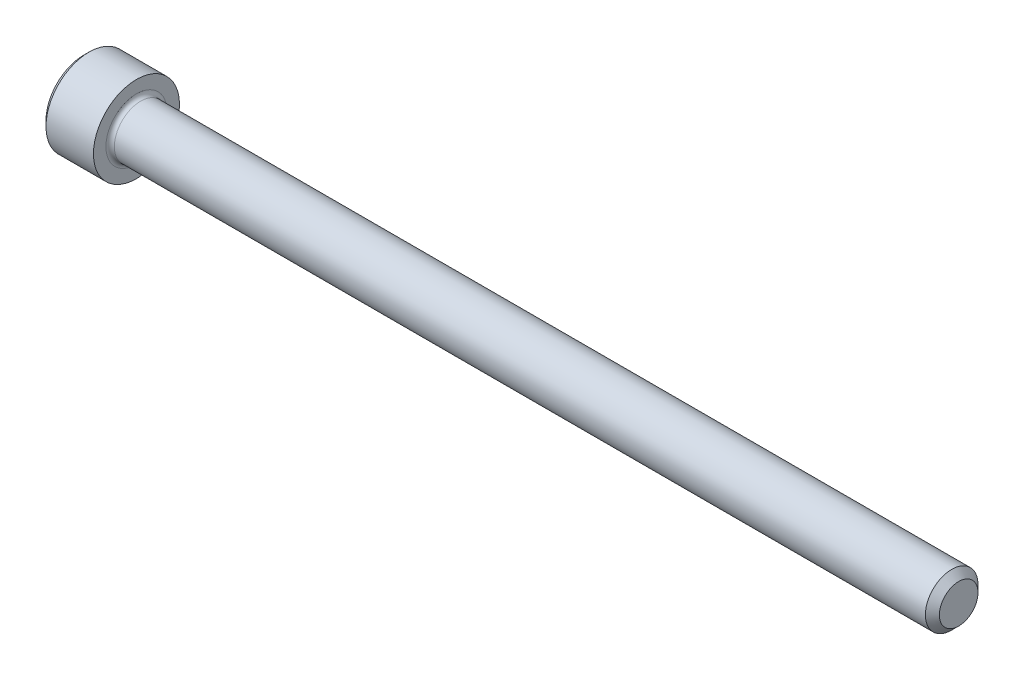
ISO-10303-21;
HEADER;
FILE_DESCRIPTION(('STEP AP214'),'2;1');
FILE_NAME('part.step','',(''),(''),'','','');
FILE_SCHEMA(('AUTOMOTIVE_DESIGN { 1 0 10303 214 1 1 1 1 }'));
ENDSEC;
DATA;
#1=APPLICATION_CONTEXT('core data for automotive mechanical design processes');
#2=APPLICATION_PROTOCOL_DEFINITION('international standard','automotive_design',2000,#1);
#3=PRODUCT_CONTEXT('',#1,'mechanical');
#4=PRODUCT('Part','Part','',(#3));
#5=PRODUCT_RELATED_PRODUCT_CATEGORY('part','',(#4));
#6=PRODUCT_DEFINITION_FORMATION('','',#4);
#7=PRODUCT_DEFINITION_CONTEXT('part definition',#1,'design');
#8=PRODUCT_DEFINITION('design','',#6,#7);
#9=PRODUCT_DEFINITION_SHAPE('','',#8);
#10=(LENGTH_UNIT() NAMED_UNIT(*) SI_UNIT(.MILLI.,.METRE.));
#11=(NAMED_UNIT(*) PLANE_ANGLE_UNIT() SI_UNIT($,.RADIAN.));
#12=(NAMED_UNIT(*) SI_UNIT($,.STERADIAN.) SOLID_ANGLE_UNIT());
#13=UNCERTAINTY_MEASURE_WITH_UNIT(LENGTH_MEASURE(1.E-05),#10,'distance_accuracy_value','');
#14=(GEOMETRIC_REPRESENTATION_CONTEXT(3) GLOBAL_UNCERTAINTY_ASSIGNED_CONTEXT((#13)) GLOBAL_UNIT_ASSIGNED_CONTEXT((#10,
#11,#12)) REPRESENTATION_CONTEXT('',''));
#15=CARTESIAN_POINT('',(0.,0.,0.));
#16=DIRECTION('',(0.,0.,1.));
#17=DIRECTION('',(1.,0.,0.));
#18=AXIS2_PLACEMENT_3D('',#15,#16,#17);
#19=CARTESIAN_POINT('',(0.,0.,0.));
#20=DIRECTION('',(-1.,0.,0.));
#21=DIRECTION('',(0.,0.,1.));
#22=AXIS2_PLACEMENT_3D('',#19,#20,#21);
#23=PLANE('',#22);
#24=DIRECTION('',(0.,-0.499999999999999,0.866025403784439));
#25=VECTOR('',#24,1.);
#26=CARTESIAN_POINT('',(0.,1.37848150271716,0.));
#27=LINE('',#26,#25);
#28=CARTESIAN_POINT('',(0.,1.37848150271716,0.));
#29=VERTEX_POINT('',#28);
#30=CARTESIAN_POINT('',(0.,0.689240751358582,1.1938));
#31=VERTEX_POINT('',#30);
#32=EDGE_CURVE('E374',#29,#31,#27,.T.);
#33=ORIENTED_EDGE('',*,*,#32,.T.);
#34=DIRECTION('',(0.,1.,0.));
#35=VECTOR('',#34,1.);
#36=CARTESIAN_POINT('',(0.,-0.689240751358569,1.1938));
#37=LINE('',#36,#35);
#38=CARTESIAN_POINT('',(0.,-0.689240751358569,1.1938));
#39=VERTEX_POINT('',#38);
#40=EDGE_CURVE('E122',#39,#31,#37,.T.);
#41=ORIENTED_EDGE('',*,*,#40,.F.);
#42=DIRECTION('',(0.,-0.500000000000001,-0.866025403784438));
#43=VECTOR('',#42,1.);
#44=CARTESIAN_POINT('',(0.,-0.689240751358569,1.1938));
#45=LINE('',#44,#43);
#46=CARTESIAN_POINT('',(0.,-1.37848150271715,0.));
#47=VERTEX_POINT('',#46);
#48=EDGE_CURVE('E377',#39,#47,#45,.T.);
#49=ORIENTED_EDGE('',*,*,#48,.T.);
#50=DIRECTION('',(0.,0.499999999999999,-0.866025403784439));
#51=VECTOR('',#50,1.);
#52=CARTESIAN_POINT('',(0.,-1.37848150271715,0.));
#53=LINE('',#52,#51);
#54=CARTESIAN_POINT('',(0.,-0.689240751358572,-1.1938));
#55=VERTEX_POINT('',#54);
#56=EDGE_CURVE('E380',#47,#55,#53,.T.);
#57=ORIENTED_EDGE('',*,*,#56,.T.);
#58=DIRECTION('',(0.,-1.,0.));
#59=VECTOR('',#58,1.);
#60=CARTESIAN_POINT('',(0.,0.689240751358578,-1.1938));
#61=LINE('',#60,#59);
#62=CARTESIAN_POINT('',(0.,0.689240751358578,-1.1938));
#63=VERTEX_POINT('',#62);
#64=EDGE_CURVE('E383',#63,#55,#61,.T.);
#65=ORIENTED_EDGE('',*,*,#64,.F.);
#66=DIRECTION('',(0.,-0.500000000000001,-0.866025403784438));
#67=VECTOR('',#66,1.);
#68=CARTESIAN_POINT('',(0.,1.37848150271716,0.));
#69=LINE('',#68,#67);
#70=EDGE_CURVE('E117',#29,#63,#69,.T.);
#71=ORIENTED_EDGE('',*,*,#70,.F.);
#72=EDGE_LOOP('',(#33,#41,#49,#57,#65,#71));
#73=FACE_BOUND('',#72,.T.);
#74=CARTESIAN_POINT('',(0.,0.,0.));
#75=DIRECTION('',(-1.,0.,0.));
#76=DIRECTION('',(0.,0.,1.));
#77=AXIS2_PLACEMENT_3D('',#74,#75,#76);
#78=CIRCLE('',#77,2.0447);
#79=CARTESIAN_POINT('',(0.,0.,2.0447));
#80=VERTEX_POINT('',#79);
#81=EDGE_CURVE('E133',#80,#80,#78,.T.);
#82=ORIENTED_EDGE('',*,*,#81,.T.);
#83=EDGE_LOOP('',(#82));
#84=FACE_BOUND('',#83,.T.);
#85=ADVANCED_FACE('F30',(#73,#84),#23,.T.);
#86=CARTESIAN_POINT('',(47.2948,1.04394,0.));
#87=DIRECTION('',(1.,0.,0.));
#88=DIRECTION('',(0.,0.,-1.));
#89=AXIS2_PLACEMENT_3D('',#86,#87,#88);
#90=PLANE('',#89);
#91=CARTESIAN_POINT('',(47.2948,0.,0.));
#92=DIRECTION('',(-1.,0.,0.));
#93=DIRECTION('',(0.,0.,1.));
#94=AXIS2_PLACEMENT_3D('',#91,#92,#93);
#95=CIRCLE('',#94,1.04394);
#96=CARTESIAN_POINT('',(47.2948,0.,1.04394));
#97=VERTEX_POINT('',#96);
#98=EDGE_CURVE('E146',#97,#97,#95,.T.);
#99=ORIENTED_EDGE('',*,*,#98,.F.);
#100=EDGE_LOOP('',(#99));
#101=FACE_BOUND('',#100,.T.);
#102=ADVANCED_FACE('F167',(#101),#90,.T.);
#103=CARTESIAN_POINT('',(47.2948,0.,0.));
#104=DIRECTION('',(-1.,0.,0.));
#105=DIRECTION('',(0.,0.,1.));
#106=AXIS2_PLACEMENT_3D('',#103,#104,#105);
#107=CONICAL_SURFACE('',#106,1.04394,0.785398163397351);
#108=CARTESIAN_POINT('',(46.91634,0.,0.));
#109=DIRECTION('',(-1.,0.,0.));
#110=DIRECTION('',(0.,0.,1.));
#111=AXIS2_PLACEMENT_3D('',#108,#109,#110);
#112=CIRCLE('',#111,1.42239999999997);
#113=CARTESIAN_POINT('',(46.91634,0.,1.42239999999997));
#114=VERTEX_POINT('',#113);
#115=EDGE_CURVE('E143',#114,#114,#112,.T.);
#116=ORIENTED_EDGE('',*,*,#115,.F.);
#117=EDGE_LOOP('',(#116));
#118=FACE_BOUND('',#117,.T.);
#119=ORIENTED_EDGE('',*,*,#98,.T.);
#120=EDGE_LOOP('',(#119));
#121=FACE_BOUND('',#120,.T.);
#122=ADVANCED_FACE('F173',(#118,#121),#107,.T.);
#123=CARTESIAN_POINT('',(-31.75,0.,0.));
#124=DIRECTION('',(-1.,0.,0.));
#125=DIRECTION('',(0.,0.,1.));
#126=AXIS2_PLACEMENT_3D('',#123,#124,#125);
#127=CYLINDRICAL_SURFACE('',#126,1.42239999999998);
#128=CARTESIAN_POINT('',(3.0734,0.,0.));
#129=DIRECTION('',(1.,0.,0.));
#130=DIRECTION('',(0.,0.,-1.));
#131=AXIS2_PLACEMENT_3D('',#128,#129,#130);
#132=CIRCLE('',#131,1.42239999999998);
#133=CARTESIAN_POINT('',(3.0734,0.,-1.42239999999998));
#134=VERTEX_POINT('',#133);
#135=EDGE_CURVE('E11',#134,#134,#132,.T.);
#136=ORIENTED_EDGE('',*,*,#135,.T.);
#137=EDGE_LOOP('',(#136));
#138=FACE_BOUND('',#137,.T.);
#139=ORIENTED_EDGE('',*,*,#115,.T.);
#140=EDGE_LOOP('',(#139));
#141=FACE_BOUND('',#140,.T.);
#142=ADVANCED_FACE('F184',(#138,#141),#127,.T.);
#143=CARTESIAN_POINT('',(2.8448,2.3241,0.));
#144=DIRECTION('',(1.,0.,0.));
#145=DIRECTION('',(0.,0.,-1.));
#146=AXIS2_PLACEMENT_3D('',#143,#144,#145);
#147=PLANE('',#146);
#148=CARTESIAN_POINT('',(2.8448,0.,0.));
#149=DIRECTION('',(1.,0.,0.));
#150=DIRECTION('',(0.,0.,-1.));
#151=AXIS2_PLACEMENT_3D('',#148,#149,#150);
#152=CIRCLE('',#151,1.65099999999998);
#153=CARTESIAN_POINT('',(2.8448,0.,-1.65099999999998));
#154=VERTEX_POINT('',#153);
#155=EDGE_CURVE('E38',#154,#154,#152,.F.);
#156=ORIENTED_EDGE('',*,*,#155,.T.);
#157=EDGE_LOOP('',(#156));
#158=FACE_BOUND('',#157,.T.);
#159=CARTESIAN_POINT('',(2.84480000000001,0.,0.));
#160=DIRECTION('',(-1.,0.,0.));
#161=DIRECTION('',(0.,0.,1.));
#162=AXIS2_PLACEMENT_3D('',#159,#160,#161);
#163=CIRCLE('',#162,2.3241);
#164=CARTESIAN_POINT('',(2.84480000000001,0.,2.3241));
#165=VERTEX_POINT('',#164);
#166=EDGE_CURVE('E140',#165,#165,#163,.T.);
#167=ORIENTED_EDGE('',*,*,#166,.F.);
#168=EDGE_LOOP('',(#167));
#169=FACE_BOUND('',#168,.T.);
#170=ADVANCED_FACE('F151',(#158,#169),#147,.T.);
#171=CARTESIAN_POINT('',(-31.75,0.,0.));
#172=DIRECTION('',(-1.,0.,0.));
#173=DIRECTION('',(0.,0.,1.));
#174=AXIS2_PLACEMENT_3D('',#171,#172,#173);
#175=CYLINDRICAL_SURFACE('',#174,2.3241);
#176=ORIENTED_EDGE('',*,*,#166,.T.);
#177=EDGE_LOOP('',(#176));
#178=FACE_BOUND('',#177,.T.);
#179=CARTESIAN_POINT('',(0.279400000000006,0.,0.));
#180=DIRECTION('',(-1.,0.,0.));
#181=DIRECTION('',(0.,0.,1.));
#182=AXIS2_PLACEMENT_3D('',#179,#180,#181);
#183=CIRCLE('',#182,2.3241);
#184=CARTESIAN_POINT('',(0.279400000000006,0.,2.3241));
#185=VERTEX_POINT('',#184);
#186=EDGE_CURVE('E137',#185,#185,#183,.T.);
#187=ORIENTED_EDGE('',*,*,#186,.F.);
#188=EDGE_LOOP('',(#187));
#189=FACE_BOUND('',#188,.T.);
#190=ADVANCED_FACE('F162',(#178,#189),#175,.T.);
#191=CARTESIAN_POINT('',(0.,0.,0.));
#192=DIRECTION('',(1.,0.,0.));
#193=DIRECTION('',(0.,0.,-1.));
#194=AXIS2_PLACEMENT_3D('',#191,#192,#193);
#195=CONICAL_SURFACE('',#194,2.0447,0.785398163397436);
#196=ORIENTED_EDGE('',*,*,#186,.T.);
#197=EDGE_LOOP('',(#196));
#198=FACE_BOUND('',#197,.T.);
#199=ORIENTED_EDGE('',*,*,#81,.F.);
#200=EDGE_LOOP('',(#199));
#201=FACE_BOUND('',#200,.T.);
#202=ADVANCED_FACE('F155',(#198,#201),#195,.T.);
#203=CARTESIAN_POINT('',(3.0734,0.,0.));
#204=DIRECTION('',(1.,0.,0.));
#205=DIRECTION('',(0.,0.,-1.));
#206=AXIS2_PLACEMENT_3D('',#203,#204,#205);
#207=TOROIDAL_SURFACE('',#206,1.65099999999998,0.2286);
#208=ORIENTED_EDGE('',*,*,#135,.F.);
#209=EDGE_LOOP('',(#208));
#210=FACE_BOUND('',#209,.T.);
#211=ORIENTED_EDGE('',*,*,#155,.F.);
#212=EDGE_LOOP('',(#211));
#213=FACE_BOUND('',#212,.T.);
#214=ADVANCED_FACE('F32',(#210,#213),#207,.F.);
#215=CARTESIAN_POINT('',(1.2954,1.37848150271716,0.));
#216=DIRECTION('',(0.,-0.866025403784439,-0.499999999999999));
#217=DIRECTION('',(0.,0.499999999999999,-0.866025403784439));
#218=AXIS2_PLACEMENT_3D('',#215,#216,#217);
#219=PLANE('',#218);
#220=ORIENTED_EDGE('',*,*,#32,.F.);
#221=DIRECTION('',(-1.,0.,0.));
#222=VECTOR('',#221,1.);
#223=CARTESIAN_POINT('',(1.2954,1.37848150271716,0.));
#224=LINE('',#223,#222);
#225=CARTESIAN_POINT('',(1.2954,1.37848150271716,0.));
#226=VERTEX_POINT('',#225);
#227=EDGE_CURVE('E373',#226,#29,#224,.T.);
#228=ORIENTED_EDGE('',*,*,#227,.F.);
#229=DIRECTION('',(0.,-0.499999999999999,0.866025403784439));
#230=VECTOR('',#229,1.);
#231=CARTESIAN_POINT('',(1.2954,1.37848150271716,0.));
#232=LINE('',#231,#230);
#233=CARTESIAN_POINT('',(1.29540000000001,1.03386112703786,0.596899999999998));
#234=VERTEX_POINT('',#233);
#235=EDGE_CURVE('E45',#226,#234,#232,.T.);
#236=ORIENTED_EDGE('',*,*,#235,.T.);
#237=CARTESIAN_POINT('',(1.2954,0.689240751358582,1.1938));
#238=VERTEX_POINT('',#237);
#239=EDGE_CURVE('E103',#234,#238,#232,.T.);
#240=ORIENTED_EDGE('',*,*,#239,.T.);
#241=DIRECTION('',(-1.,0.,0.));
#242=VECTOR('',#241,1.);
#243=CARTESIAN_POINT('',(1.2954,0.689240751358582,1.1938));
#244=LINE('',#243,#242);
#245=EDGE_CURVE('E115',#238,#31,#244,.T.);
#246=ORIENTED_EDGE('',*,*,#245,.T.);
#247=EDGE_LOOP('',(#220,#228,#236,#240,#246));
#248=FACE_BOUND('',#247,.T.);
#249=ADVANCED_FACE('F114',(#248),#219,.T.);
#250=CARTESIAN_POINT('',(1.2954,-0.689240751358569,1.1938));
#251=DIRECTION('',(0.,0.,1.));
#252=DIRECTION('',(0.,-1.,0.));
#253=AXIS2_PLACEMENT_3D('',#250,#251,#252);
#254=PLANE('',#253);
#255=ORIENTED_EDGE('',*,*,#40,.T.);
#256=ORIENTED_EDGE('',*,*,#245,.F.);
#257=DIRECTION('',(0.,1.,0.));
#258=VECTOR('',#257,1.);
#259=CARTESIAN_POINT('',(1.2954,-0.689240751358569,1.1938));
#260=LINE('',#259,#258);
#261=CARTESIAN_POINT('',(1.2954,0.,1.1938));
#262=VERTEX_POINT('',#261);
#263=EDGE_CURVE('E101',#262,#238,#260,.T.);
#264=ORIENTED_EDGE('',*,*,#263,.F.);
#265=CARTESIAN_POINT('',(1.2954,-0.689240751358569,1.1938));
#266=VERTEX_POINT('',#265);
#267=EDGE_CURVE('E111',#266,#262,#260,.T.);
#268=ORIENTED_EDGE('',*,*,#267,.F.);
#269=DIRECTION('',(-1.,0.,0.));
#270=VECTOR('',#269,1.);
#271=CARTESIAN_POINT('',(1.2954,-0.689240751358569,1.1938));
#272=LINE('',#271,#270);
#273=EDGE_CURVE('E124',#266,#39,#272,.T.);
#274=ORIENTED_EDGE('',*,*,#273,.T.);
#275=EDGE_LOOP('',(#255,#256,#264,#268,#274));
#276=FACE_BOUND('',#275,.T.);
#277=ADVANCED_FACE('F119',(#276),#254,.F.);
#278=CARTESIAN_POINT('',(1.2954,-0.689240751358569,1.1938));
#279=DIRECTION('',(0.,0.866025403784438,-0.500000000000001));
#280=DIRECTION('',(0.,0.500000000000001,0.866025403784438));
#281=AXIS2_PLACEMENT_3D('',#278,#279,#280);
#282=PLANE('',#281);
#283=ORIENTED_EDGE('',*,*,#48,.F.);
#284=ORIENTED_EDGE('',*,*,#273,.F.);
#285=DIRECTION('',(0.,-0.500000000000001,-0.866025403784438));
#286=VECTOR('',#285,1.);
#287=CARTESIAN_POINT('',(1.2954,-0.689240751358569,1.1938));
#288=LINE('',#287,#286);
#289=CARTESIAN_POINT('',(1.2954,-1.03386112703786,0.596899999999999));
#290=VERTEX_POINT('',#289);
#291=EDGE_CURVE('E354',#266,#290,#288,.T.);
#292=ORIENTED_EDGE('',*,*,#291,.T.);
#293=CARTESIAN_POINT('',(1.2954,-1.37848150271715,0.));
#294=VERTEX_POINT('',#293);
#295=EDGE_CURVE('E356',#290,#294,#288,.T.);
#296=ORIENTED_EDGE('',*,*,#295,.T.);
#297=DIRECTION('',(-1.,0.,0.));
#298=VECTOR('',#297,1.);
#299=CARTESIAN_POINT('',(1.2954,-1.37848150271715,0.));
#300=LINE('',#299,#298);
#301=EDGE_CURVE('E129',#294,#47,#300,.T.);
#302=ORIENTED_EDGE('',*,*,#301,.T.);
#303=EDGE_LOOP('',(#283,#284,#292,#296,#302));
#304=FACE_BOUND('',#303,.T.);
#305=ADVANCED_FACE('F246',(#304),#282,.T.);
#306=CARTESIAN_POINT('',(1.2954,-1.37848150271715,0.));
#307=DIRECTION('',(0.,0.866025403784439,0.499999999999999));
#308=DIRECTION('',(0.,-0.499999999999999,0.866025403784439));
#309=AXIS2_PLACEMENT_3D('',#306,#307,#308);
#310=PLANE('',#309);
#311=ORIENTED_EDGE('',*,*,#56,.F.);
#312=ORIENTED_EDGE('',*,*,#301,.F.);
#313=DIRECTION('',(0.,0.499999999999999,-0.866025403784439));
#314=VECTOR('',#313,1.);
#315=CARTESIAN_POINT('',(1.2954,-1.37848150271715,0.));
#316=LINE('',#315,#314);
#317=CARTESIAN_POINT('',(1.2954,-1.03386112703786,-0.596899999999997));
#318=VERTEX_POINT('',#317);
#319=EDGE_CURVE('E359',#294,#318,#316,.T.);
#320=ORIENTED_EDGE('',*,*,#319,.T.);
#321=CARTESIAN_POINT('',(1.2954,-0.689240751358572,-1.1938));
#322=VERTEX_POINT('',#321);
#323=EDGE_CURVE('E363',#318,#322,#316,.T.);
#324=ORIENTED_EDGE('',*,*,#323,.T.);
#325=DIRECTION('',(-1.,0.,0.));
#326=VECTOR('',#325,1.);
#327=CARTESIAN_POINT('',(1.2954,-0.689240751358572,-1.1938));
#328=LINE('',#327,#326);
#329=EDGE_CURVE('E392',#322,#55,#328,.T.);
#330=ORIENTED_EDGE('',*,*,#329,.T.);
#331=EDGE_LOOP('',(#311,#312,#320,#324,#330));
#332=FACE_BOUND('',#331,.T.);
#333=ADVANCED_FACE('F254',(#332),#310,.T.);
#334=CARTESIAN_POINT('',(1.2954,0.689240751358578,-1.1938));
#335=DIRECTION('',(0.,0.,-1.));
#336=DIRECTION('',(0.,1.,0.));
#337=AXIS2_PLACEMENT_3D('',#334,#335,#336);
#338=PLANE('',#337);
#339=ORIENTED_EDGE('',*,*,#64,.T.);
#340=ORIENTED_EDGE('',*,*,#329,.F.);
#341=DIRECTION('',(0.,-1.,0.));
#342=VECTOR('',#341,1.);
#343=CARTESIAN_POINT('',(1.2954,0.689240751358578,-1.1938));
#344=LINE('',#343,#342);
#345=CARTESIAN_POINT('',(1.2954,0.,-1.1938));
#346=VERTEX_POINT('',#345);
#347=EDGE_CURVE('E367',#346,#322,#344,.T.);
#348=ORIENTED_EDGE('',*,*,#347,.F.);
#349=CARTESIAN_POINT('',(1.2954,0.689240751358578,-1.1938));
#350=VERTEX_POINT('',#349);
#351=EDGE_CURVE('E368',#350,#346,#344,.T.);
#352=ORIENTED_EDGE('',*,*,#351,.F.);
#353=DIRECTION('',(-1.,0.,0.));
#354=VECTOR('',#353,1.);
#355=CARTESIAN_POINT('',(1.2954,0.689240751358578,-1.1938));
#356=LINE('',#355,#354);
#357=EDGE_CURVE('E389',#350,#63,#356,.T.);
#358=ORIENTED_EDGE('',*,*,#357,.T.);
#359=EDGE_LOOP('',(#339,#340,#348,#352,#358));
#360=FACE_BOUND('',#359,.T.);
#361=ADVANCED_FACE('F263',(#360),#338,.F.);
#362=CARTESIAN_POINT('',(1.2954,1.37848150271716,0.));
#363=DIRECTION('',(0.,0.866025403784438,-0.500000000000001));
#364=DIRECTION('',(0.,0.500000000000001,0.866025403784438));
#365=AXIS2_PLACEMENT_3D('',#362,#363,#364);
#366=PLANE('',#365);
#367=ORIENTED_EDGE('',*,*,#70,.T.);
#368=ORIENTED_EDGE('',*,*,#357,.F.);
#369=DIRECTION('',(0.,-0.500000000000001,-0.866025403784438));
#370=VECTOR('',#369,1.);
#371=CARTESIAN_POINT('',(1.2954,1.37848150271716,0.));
#372=LINE('',#371,#370);
#373=CARTESIAN_POINT('',(1.2954,1.03386112703787,-0.596900000000004));
#374=VERTEX_POINT('',#373);
#375=EDGE_CURVE('E371',#374,#350,#372,.T.);
#376=ORIENTED_EDGE('',*,*,#375,.F.);
#377=EDGE_CURVE('E345',#226,#374,#372,.T.);
#378=ORIENTED_EDGE('',*,*,#377,.F.);
#379=ORIENTED_EDGE('',*,*,#227,.T.);
#380=EDGE_LOOP('',(#367,#368,#376,#378,#379));
#381=FACE_BOUND('',#380,.T.);
#382=ADVANCED_FACE('F272',(#381),#366,.F.);
#383=CARTESIAN_POINT('',(1.2954,0.689240751358581,1.1938));
#384=DIRECTION('',(-1.,0.,0.));
#385=DIRECTION('',(0.,0.,1.));
#386=AXIS2_PLACEMENT_3D('',#383,#384,#385);
#387=PLANE('',#386);
#388=CARTESIAN_POINT('',(1.29540000000001,0.,0.));
#389=DIRECTION('',(-1.,0.,0.));
#390=DIRECTION('',(0.,0.,1.));
#391=AXIS2_PLACEMENT_3D('',#388,#389,#390);
#392=CIRCLE('',#391,1.1938);
#393=EDGE_CURVE('E123',#290,#262,#392,.T.);
#394=ORIENTED_EDGE('',*,*,#393,.F.);
#395=ORIENTED_EDGE('',*,*,#291,.F.);
#396=ORIENTED_EDGE('',*,*,#267,.T.);
#397=EDGE_LOOP('',(#394,#395,#396));
#398=FACE_BOUND('',#397,.T.);
#399=ADVANCED_FACE('F281',(#398),#387,.T.);
#400=EDGE_CURVE('E127',#318,#290,#392,.T.);
#401=ORIENTED_EDGE('',*,*,#400,.F.);
#402=ORIENTED_EDGE('',*,*,#319,.F.);
#403=ORIENTED_EDGE('',*,*,#295,.F.);
#404=EDGE_LOOP('',(#401,#402,#403));
#405=FACE_BOUND('',#404,.T.);
#406=ADVANCED_FACE('F290',(#405),#387,.T.);
#407=EDGE_CURVE('E398',#346,#318,#392,.T.);
#408=ORIENTED_EDGE('',*,*,#407,.F.);
#409=ORIENTED_EDGE('',*,*,#347,.T.);
#410=ORIENTED_EDGE('',*,*,#323,.F.);
#411=EDGE_LOOP('',(#408,#409,#410));
#412=FACE_BOUND('',#411,.T.);
#413=ADVANCED_FACE('F299',(#412),#387,.T.);
#414=EDGE_CURVE('E348',#374,#346,#392,.T.);
#415=ORIENTED_EDGE('',*,*,#414,.F.);
#416=ORIENTED_EDGE('',*,*,#375,.T.);
#417=ORIENTED_EDGE('',*,*,#351,.T.);
#418=EDGE_LOOP('',(#415,#416,#417));
#419=FACE_BOUND('',#418,.T.);
#420=ADVANCED_FACE('F307',(#419),#387,.T.);
#421=EDGE_CURVE('E134',#234,#374,#392,.T.);
#422=ORIENTED_EDGE('',*,*,#421,.F.);
#423=ORIENTED_EDGE('',*,*,#235,.F.);
#424=ORIENTED_EDGE('',*,*,#377,.T.);
#425=EDGE_LOOP('',(#422,#423,#424));
#426=FACE_BOUND('',#425,.T.);
#427=ADVANCED_FACE('F315',(#426),#387,.T.);
#428=EDGE_CURVE('E106',#262,#234,#392,.T.);
#429=ORIENTED_EDGE('',*,*,#428,.F.);
#430=ORIENTED_EDGE('',*,*,#263,.T.);
#431=ORIENTED_EDGE('',*,*,#239,.F.);
#432=EDGE_LOOP('',(#429,#430,#431));
#433=FACE_BOUND('',#432,.T.);
#434=ADVANCED_FACE('F102',(#433),#387,.T.);
#435=CARTESIAN_POINT('',(1.29540000000001,0.,0.));
#436=DIRECTION('',(-1.,0.,0.));
#437=DIRECTION('',(0.,0.,1.));
#438=AXIS2_PLACEMENT_3D('',#435,#436,#437);
#439=CONICAL_SURFACE('',#438,1.1938,1.04719755119659);
#440=CARTESIAN_POINT('',(1.98464075135859,0.,0.));
#441=VERTEX_POINT('',#440);
#442=VERTEX_LOOP('',#441);
#443=FACE_BOUND('',#442,.T.);
#444=ORIENTED_EDGE('',*,*,#428,.T.);
#445=ORIENTED_EDGE('',*,*,#421,.T.);
#446=ORIENTED_EDGE('',*,*,#414,.T.);
#447=ORIENTED_EDGE('',*,*,#407,.T.);
#448=ORIENTED_EDGE('',*,*,#400,.T.);
#449=ORIENTED_EDGE('',*,*,#393,.T.);
#450=EDGE_LOOP('',(#444,#445,#446,#447,#448,#449));
#451=FACE_BOUND('',#450,.T.);
#452=ADVANCED_FACE('F177',(#443,#451),#439,.F.);
#453=CLOSED_SHELL('',(#85,#102,#122,#142,#170,#190,#202,#214,#249,#277,#305,#333,#361,#382,#399,
#406,#413,#420,#427,#434,#452));
#454=MANIFOLD_SOLID_BREP('B2',#453);
#455=ADVANCED_BREP_SHAPE_REPRESENTATION('',(#18,#454),#14);
#456=SHAPE_DEFINITION_REPRESENTATION(#9,#455);
ENDSEC;
END-ISO-10303-21;
